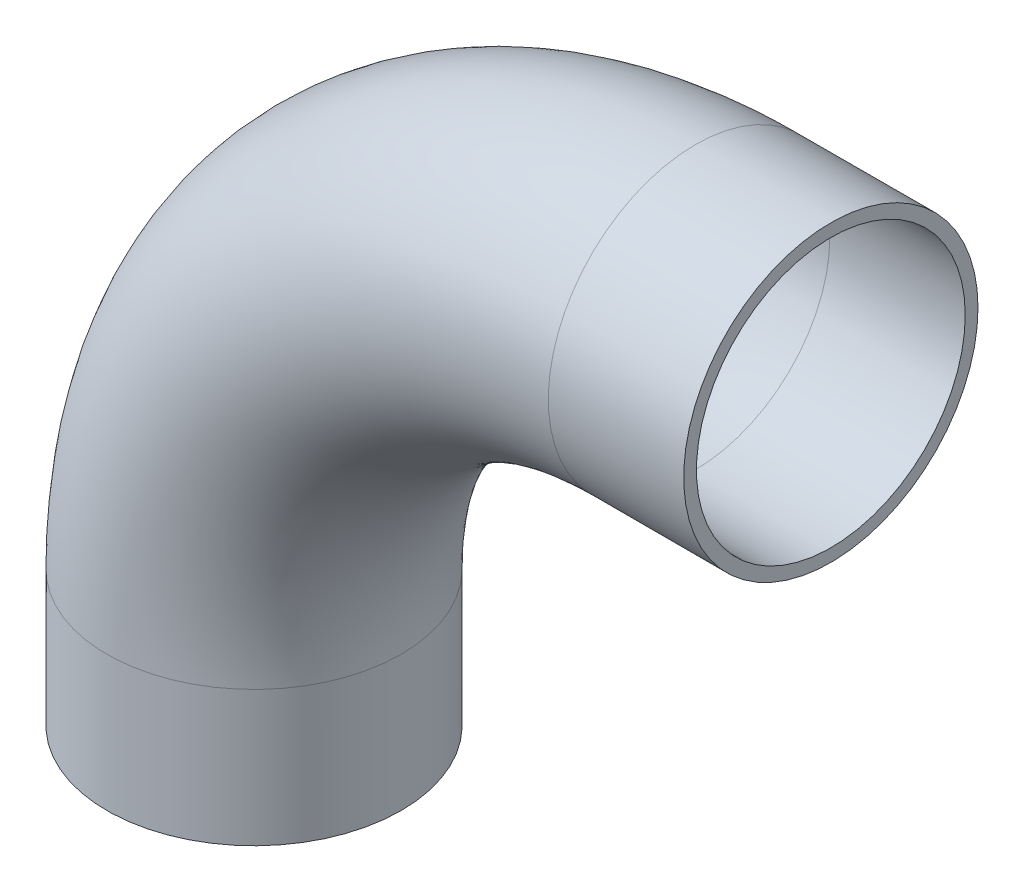
ISO-10303-21;
HEADER;
FILE_DESCRIPTION(('STEP AP214'),'2;1');
FILE_NAME('part.step','',(''),(''),'','','');
FILE_SCHEMA(('AUTOMOTIVE_DESIGN { 1 0 10303 214 1 1 1 1 }'));
ENDSEC;
DATA;
#1=APPLICATION_CONTEXT('core data for automotive mechanical design processes');
#2=APPLICATION_PROTOCOL_DEFINITION('international standard','automotive_design',2000,#1);
#3=PRODUCT_CONTEXT('',#1,'mechanical');
#4=PRODUCT('Part','Part','',(#3));
#5=PRODUCT_RELATED_PRODUCT_CATEGORY('part','',(#4));
#6=PRODUCT_DEFINITION_FORMATION('','',#4);
#7=PRODUCT_DEFINITION_CONTEXT('part definition',#1,'design');
#8=PRODUCT_DEFINITION('design','',#6,#7);
#9=PRODUCT_DEFINITION_SHAPE('','',#8);
#10=(LENGTH_UNIT() NAMED_UNIT(*) SI_UNIT(.MILLI.,.METRE.));
#11=(NAMED_UNIT(*) PLANE_ANGLE_UNIT() SI_UNIT($,.RADIAN.));
#12=(NAMED_UNIT(*) SI_UNIT($,.STERADIAN.) SOLID_ANGLE_UNIT());
#13=UNCERTAINTY_MEASURE_WITH_UNIT(LENGTH_MEASURE(1.E-05),#10,'distance_accuracy_value','');
#14=(GEOMETRIC_REPRESENTATION_CONTEXT(3) GLOBAL_UNCERTAINTY_ASSIGNED_CONTEXT((#13)) GLOBAL_UNIT_ASSIGNED_CONTEXT((#10,
#11,#12)) REPRESENTATION_CONTEXT('',''));
#15=CARTESIAN_POINT('',(0.,0.,0.));
#16=DIRECTION('',(0.,0.,1.));
#17=DIRECTION('',(1.,0.,0.));
#18=AXIS2_PLACEMENT_3D('',#15,#16,#17);
#19=CARTESIAN_POINT('',(57.15,17.526,0.));
#20=DIRECTION('',(0.,0.,-1.));
#21=DIRECTION('',(-1.,0.,0.));
#22=AXIS2_PLACEMENT_3D('',#19,#20,#21);
#23=TOROIDAL_SURFACE('',#22,57.15,17.399);
#24=CARTESIAN_POINT('',(57.15,74.676,0.));
#25=DIRECTION('',(1.,0.,0.));
#26=DIRECTION('',(0.,0.,-1.));
#27=AXIS2_PLACEMENT_3D('',#24,#25,#26);
#28=CIRCLE('',#27,17.399);
#29=CARTESIAN_POINT('',(57.15,74.676,-17.399));
#30=VERTEX_POINT('',#29);
#31=EDGE_CURVE('E35',#30,#30,#28,.T.);
#32=ORIENTED_EDGE('',*,*,#31,.T.);
#33=EDGE_LOOP('',(#32));
#34=FACE_BOUND('',#33,.T.);
#35=CARTESIAN_POINT('',(0.,17.526,0.));
#36=DIRECTION('',(0.,-1.,0.));
#37=DIRECTION('',(1.,0.,0.));
#38=AXIS2_PLACEMENT_3D('',#35,#36,#37);
#39=CIRCLE('',#38,17.399);
#40=CARTESIAN_POINT('',(17.399,17.526,0.));
#41=VERTEX_POINT('',#40);
#42=EDGE_CURVE('E38',#41,#41,#39,.T.);
#43=ORIENTED_EDGE('',*,*,#42,.T.);
#44=EDGE_LOOP('',(#43));
#45=FACE_BOUND('',#44,.T.);
#46=ADVANCED_FACE('F14',(#34,#45),#23,.F.);
#47=CARTESIAN_POINT('',(0.,17.526,0.));
#48=DIRECTION('',(0.,-1.,0.));
#49=DIRECTION('',(1.,0.,0.));
#50=AXIS2_PLACEMENT_3D('',#47,#48,#49);
#51=CYLINDRICAL_SURFACE('',#50,17.399);
#52=CARTESIAN_POINT('',(0.,0.,0.));
#53=DIRECTION('',(0.,-1.,0.));
#54=DIRECTION('',(1.,0.,0.));
#55=AXIS2_PLACEMENT_3D('',#52,#53,#54);
#56=CIRCLE('',#55,17.399);
#57=CARTESIAN_POINT('',(17.399,0.,0.));
#58=VERTEX_POINT('',#57);
#59=EDGE_CURVE('E18',#58,#58,#56,.T.);
#60=ORIENTED_EDGE('',*,*,#59,.T.);
#61=EDGE_LOOP('',(#60));
#62=FACE_BOUND('',#61,.T.);
#63=ORIENTED_EDGE('',*,*,#42,.F.);
#64=EDGE_LOOP('',(#63));
#65=FACE_BOUND('',#64,.T.);
#66=ADVANCED_FACE('F52',(#62,#65),#51,.F.);
#67=CARTESIAN_POINT('',(57.15,74.676,0.));
#68=DIRECTION('',(1.,0.,0.));
#69=DIRECTION('',(0.,0.,-1.));
#70=AXIS2_PLACEMENT_3D('',#67,#68,#69);
#71=CYLINDRICAL_SURFACE('',#70,17.399);
#72=CARTESIAN_POINT('',(74.676,74.676,0.));
#73=DIRECTION('',(1.,0.,0.));
#74=DIRECTION('',(0.,0.,-1.));
#75=AXIS2_PLACEMENT_3D('',#72,#73,#74);
#76=CIRCLE('',#75,17.399);
#77=CARTESIAN_POINT('',(74.676,74.676,-17.399));
#78=VERTEX_POINT('',#77);
#79=EDGE_CURVE('E45',#78,#78,#76,.F.);
#80=ORIENTED_EDGE('',*,*,#79,.F.);
#81=EDGE_LOOP('',(#80));
#82=FACE_BOUND('',#81,.T.);
#83=ORIENTED_EDGE('',*,*,#31,.F.);
#84=EDGE_LOOP('',(#83));
#85=FACE_BOUND('',#84,.T.);
#86=ADVANCED_FACE('F58',(#82,#85),#71,.F.);
#87=CARTESIAN_POINT('',(0.,0.,0.));
#88=DIRECTION('',(0.,1.,0.));
#89=DIRECTION('',(0.,0.,1.));
#90=AXIS2_PLACEMENT_3D('',#87,#88,#89);
#91=PLANE('',#90);
#92=CARTESIAN_POINT('',(0.,0.,0.));
#93=DIRECTION('',(0.,-1.,0.));
#94=DIRECTION('',(1.,0.,0.));
#95=AXIS2_PLACEMENT_3D('',#92,#93,#94);
#96=CIRCLE('',#95,19.05);
#97=CARTESIAN_POINT('',(19.05,0.,0.));
#98=VERTEX_POINT('',#97);
#99=EDGE_CURVE('E43',#98,#98,#96,.F.);
#100=ORIENTED_EDGE('',*,*,#99,.F.);
#101=EDGE_LOOP('',(#100));
#102=FACE_BOUND('',#101,.T.);
#103=ORIENTED_EDGE('',*,*,#59,.F.);
#104=EDGE_LOOP('',(#103));
#105=FACE_BOUND('',#104,.T.);
#106=ADVANCED_FACE('F55',(#102,#105),#91,.F.);
#107=CARTESIAN_POINT('',(74.676,74.676,0.));
#108=DIRECTION('',(1.,0.,0.));
#109=DIRECTION('',(0.,1.,0.));
#110=AXIS2_PLACEMENT_3D('',#107,#108,#109);
#111=PLANE('',#110);
#112=CARTESIAN_POINT('',(74.676,74.676,0.));
#113=DIRECTION('',(1.,0.,0.));
#114=DIRECTION('',(0.,0.,-1.));
#115=AXIS2_PLACEMENT_3D('',#112,#113,#114);
#116=CIRCLE('',#115,19.05);
#117=CARTESIAN_POINT('',(74.676,74.676,-19.05));
#118=VERTEX_POINT('',#117);
#119=EDGE_CURVE('E27',#118,#118,#116,.F.);
#120=ORIENTED_EDGE('',*,*,#119,.F.);
#121=EDGE_LOOP('',(#120));
#122=FACE_BOUND('',#121,.T.);
#123=ORIENTED_EDGE('',*,*,#79,.T.);
#124=EDGE_LOOP('',(#123));
#125=FACE_BOUND('',#124,.T.);
#126=ADVANCED_FACE('F57',(#122,#125),#111,.T.);
#127=CARTESIAN_POINT('',(0.,17.526,0.));
#128=DIRECTION('',(0.,-1.,0.));
#129=DIRECTION('',(1.,0.,0.));
#130=AXIS2_PLACEMENT_3D('',#127,#128,#129);
#131=CYLINDRICAL_SURFACE('',#130,19.05);
#132=ORIENTED_EDGE('',*,*,#99,.T.);
#133=EDGE_LOOP('',(#132));
#134=FACE_BOUND('',#133,.T.);
#135=CARTESIAN_POINT('',(0.,17.526,0.));
#136=DIRECTION('',(0.,1.,0.));
#137=DIRECTION('',(-1.,0.,0.));
#138=AXIS2_PLACEMENT_3D('',#135,#136,#137);
#139=CIRCLE('',#138,19.05);
#140=CARTESIAN_POINT('',(-19.05,17.526,0.));
#141=VERTEX_POINT('',#140);
#142=EDGE_CURVE('E22',#141,#141,#139,.T.);
#143=ORIENTED_EDGE('',*,*,#142,.F.);
#144=EDGE_LOOP('',(#143));
#145=FACE_BOUND('',#144,.T.);
#146=ADVANCED_FACE('F66',(#134,#145),#131,.T.);
#147=CARTESIAN_POINT('',(57.15,74.676,0.));
#148=DIRECTION('',(1.,0.,0.));
#149=DIRECTION('',(0.,0.,-1.));
#150=AXIS2_PLACEMENT_3D('',#147,#148,#149);
#151=CYLINDRICAL_SURFACE('',#150,19.05);
#152=ORIENTED_EDGE('',*,*,#119,.T.);
#153=EDGE_LOOP('',(#152));
#154=FACE_BOUND('',#153,.T.);
#155=CARTESIAN_POINT('',(57.15,74.6759999999999,0.));
#156=DIRECTION('',(1.,0.,0.));
#157=DIRECTION('',(0.,1.,0.));
#158=AXIS2_PLACEMENT_3D('',#155,#156,#157);
#159=CIRCLE('',#158,19.05);
#160=CARTESIAN_POINT('',(57.15,93.7259999999999,0.));
#161=VERTEX_POINT('',#160);
#162=EDGE_CURVE('E9',#161,#161,#159,.F.);
#163=ORIENTED_EDGE('',*,*,#162,.F.);
#164=EDGE_LOOP('',(#163));
#165=FACE_BOUND('',#164,.T.);
#166=ADVANCED_FACE('F74',(#154,#165),#151,.T.);
#167=CARTESIAN_POINT('',(57.15,17.526,0.));
#168=DIRECTION('',(0.,0.,-1.));
#169=DIRECTION('',(-1.,0.,0.));
#170=AXIS2_PLACEMENT_3D('',#167,#168,#169);
#171=TOROIDAL_SURFACE('',#170,57.15,19.05);
#172=ORIENTED_EDGE('',*,*,#142,.T.);
#173=EDGE_LOOP('',(#172));
#174=FACE_BOUND('',#173,.T.);
#175=ORIENTED_EDGE('',*,*,#162,.T.);
#176=EDGE_LOOP('',(#175));
#177=FACE_BOUND('',#176,.T.);
#178=ADVANCED_FACE('F72',(#174,#177),#171,.T.);
#179=CLOSED_SHELL('',(#46,#66,#86,#106,#126,#146,#166,#178));
#180=MANIFOLD_SOLID_BREP('B1',#179);
#181=ADVANCED_BREP_SHAPE_REPRESENTATION('',(#18,#180),#14);
#182=SHAPE_DEFINITION_REPRESENTATION(#9,#181);
ENDSEC;
END-ISO-10303-21;
